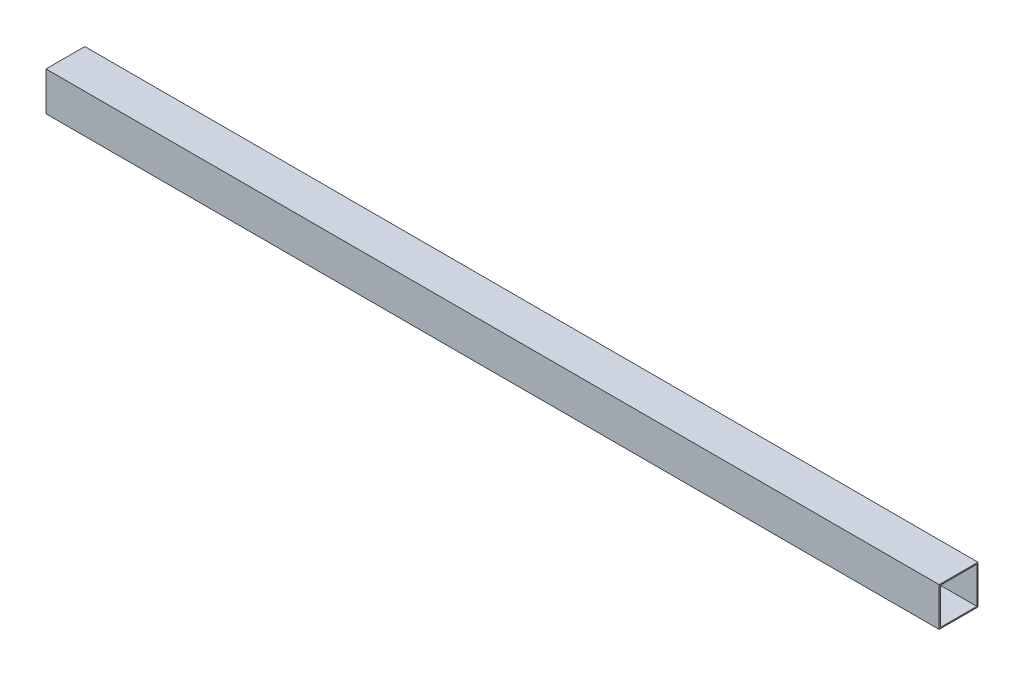
ISO-10303-21;
HEADER;
FILE_DESCRIPTION(('STEP AP214'),'2;1');
FILE_NAME('part.step','',(''),(''),'','','');
FILE_SCHEMA(('AUTOMOTIVE_DESIGN { 1 0 10303 214 1 1 1 1 }'));
ENDSEC;
DATA;
#1=APPLICATION_CONTEXT('core data for automotive mechanical design processes');
#2=APPLICATION_PROTOCOL_DEFINITION('international standard','automotive_design',2000,#1);
#3=PRODUCT_CONTEXT('',#1,'mechanical');
#4=PRODUCT('Part','Part','',(#3));
#5=PRODUCT_RELATED_PRODUCT_CATEGORY('part','',(#4));
#6=PRODUCT_DEFINITION_FORMATION('','',#4);
#7=PRODUCT_DEFINITION_CONTEXT('part definition',#1,'design');
#8=PRODUCT_DEFINITION('design','',#6,#7);
#9=PRODUCT_DEFINITION_SHAPE('','',#8);
#10=(LENGTH_UNIT() NAMED_UNIT(*) SI_UNIT(.MILLI.,.METRE.));
#11=(NAMED_UNIT(*) PLANE_ANGLE_UNIT() SI_UNIT($,.RADIAN.));
#12=(NAMED_UNIT(*) SI_UNIT($,.STERADIAN.) SOLID_ANGLE_UNIT());
#13=UNCERTAINTY_MEASURE_WITH_UNIT(LENGTH_MEASURE(1.E-05),#10,'distance_accuracy_value','');
#14=(GEOMETRIC_REPRESENTATION_CONTEXT(3) GLOBAL_UNCERTAINTY_ASSIGNED_CONTEXT((#13)) GLOBAL_UNIT_ASSIGNED_CONTEXT((#10,
#11,#12)) REPRESENTATION_CONTEXT('',''));
#15=CARTESIAN_POINT('',(0.,0.,0.));
#16=DIRECTION('',(0.,0.,1.));
#17=DIRECTION('',(1.,0.,0.));
#18=AXIS2_PLACEMENT_3D('',#15,#16,#17);
#19=CARTESIAN_POINT('',(584.2,0.,0.));
#20=DIRECTION('',(1.,0.,0.));
#21=DIRECTION('',(0.,0.,-1.));
#22=AXIS2_PLACEMENT_3D('',#19,#20,#21);
#23=PLANE('',#22);
#24=DIRECTION('',(0.,-1.,0.));
#25=VECTOR('',#24,1.);
#26=CARTESIAN_POINT('',(584.2,0.,0.));
#27=LINE('',#26,#25);
#28=CARTESIAN_POINT('',(584.2,25.4,0.));
#29=VERTEX_POINT('',#28);
#30=CARTESIAN_POINT('',(584.2,0.,0.));
#31=VERTEX_POINT('',#30);
#32=EDGE_CURVE('E158',#29,#31,#27,.T.);
#33=ORIENTED_EDGE('',*,*,#32,.T.);
#34=DIRECTION('',(0.,0.,-1.));
#35=VECTOR('',#34,1.);
#36=CARTESIAN_POINT('',(584.2,0.,0.));
#37=LINE('',#36,#35);
#38=CARTESIAN_POINT('',(584.2,0.,-25.4));
#39=VERTEX_POINT('',#38);
#40=EDGE_CURVE('E161',#31,#39,#37,.T.);
#41=ORIENTED_EDGE('',*,*,#40,.T.);
#42=DIRECTION('',(0.,1.,0.));
#43=VECTOR('',#42,1.);
#44=CARTESIAN_POINT('',(584.2,0.,-25.4));
#45=LINE('',#44,#43);
#46=CARTESIAN_POINT('',(584.2,25.4,-25.4));
#47=VERTEX_POINT('',#46);
#48=EDGE_CURVE('E164',#39,#47,#45,.T.);
#49=ORIENTED_EDGE('',*,*,#48,.T.);
#50=DIRECTION('',(0.,0.,1.));
#51=VECTOR('',#50,1.);
#52=CARTESIAN_POINT('',(584.2,25.4,0.));
#53=LINE('',#52,#51);
#54=EDGE_CURVE('E166',#47,#29,#53,.T.);
#55=ORIENTED_EDGE('',*,*,#54,.T.);
#56=EDGE_LOOP('',(#33,#41,#49,#55));
#57=FACE_BOUND('',#56,.T.);
#58=DIRECTION('',(0.,0.,-1.));
#59=VECTOR('',#58,1.);
#60=CARTESIAN_POINT('',(584.2,0.762,0.));
#61=LINE('',#60,#59);
#62=CARTESIAN_POINT('',(584.2,0.762,-0.762));
#63=VERTEX_POINT('',#62);
#64=CARTESIAN_POINT('',(584.2,0.762,-24.638));
#65=VERTEX_POINT('',#64);
#66=EDGE_CURVE('E130',#63,#65,#61,.T.);
#67=ORIENTED_EDGE('',*,*,#66,.F.);
#68=DIRECTION('',(0.,-1.,0.));
#69=VECTOR('',#68,1.);
#70=CARTESIAN_POINT('',(584.2,0.,-0.762));
#71=LINE('',#70,#69);
#72=CARTESIAN_POINT('',(584.2,24.638,-0.762));
#73=VERTEX_POINT('',#72);
#74=EDGE_CURVE('E122',#73,#63,#71,.T.);
#75=ORIENTED_EDGE('',*,*,#74,.F.);
#76=DIRECTION('',(0.,0.,1.));
#77=VECTOR('',#76,1.);
#78=CARTESIAN_POINT('',(584.2,24.638,0.));
#79=LINE('',#78,#77);
#80=CARTESIAN_POINT('',(584.2,24.638,-24.638));
#81=VERTEX_POINT('',#80);
#82=EDGE_CURVE('E144',#81,#73,#79,.T.);
#83=ORIENTED_EDGE('',*,*,#82,.F.);
#84=DIRECTION('',(0.,1.,0.));
#85=VECTOR('',#84,1.);
#86=CARTESIAN_POINT('',(584.2,0.,-24.638));
#87=LINE('',#86,#85);
#88=EDGE_CURVE('E142',#65,#81,#87,.T.);
#89=ORIENTED_EDGE('',*,*,#88,.F.);
#90=EDGE_LOOP('',(#67,#75,#83,#89));
#91=FACE_BOUND('',#90,.T.);
#92=ADVANCED_FACE('F57',(#57,#91),#23,.T.);
#93=CARTESIAN_POINT('',(0.,0.,0.));
#94=DIRECTION('',(1.,0.,0.));
#95=DIRECTION('',(0.,0.,-1.));
#96=AXIS2_PLACEMENT_3D('',#93,#94,#95);
#97=PLANE('',#96);
#98=DIRECTION('',(0.,-1.,0.));
#99=VECTOR('',#98,1.);
#100=CARTESIAN_POINT('',(0.,0.,0.));
#101=LINE('',#100,#99);
#102=CARTESIAN_POINT('',(0.,25.4,0.));
#103=VERTEX_POINT('',#102);
#104=CARTESIAN_POINT('',(0.,0.,0.));
#105=VERTEX_POINT('',#104);
#106=EDGE_CURVE('E138',#103,#105,#101,.T.);
#107=ORIENTED_EDGE('',*,*,#106,.F.);
#108=DIRECTION('',(0.,0.,1.));
#109=VECTOR('',#108,1.);
#110=CARTESIAN_POINT('',(0.,25.4,0.));
#111=LINE('',#110,#109);
#112=CARTESIAN_POINT('',(0.,25.4,-25.4));
#113=VERTEX_POINT('',#112);
#114=EDGE_CURVE('E162',#113,#103,#111,.T.);
#115=ORIENTED_EDGE('',*,*,#114,.F.);
#116=DIRECTION('',(0.,1.,0.));
#117=VECTOR('',#116,1.);
#118=CARTESIAN_POINT('',(0.,0.,-25.4));
#119=LINE('',#118,#117);
#120=CARTESIAN_POINT('',(0.,0.,-25.4));
#121=VERTEX_POINT('',#120);
#122=EDGE_CURVE('E173',#121,#113,#119,.T.);
#123=ORIENTED_EDGE('',*,*,#122,.F.);
#124=DIRECTION('',(0.,0.,-1.));
#125=VECTOR('',#124,1.);
#126=CARTESIAN_POINT('',(0.,0.,0.));
#127=LINE('',#126,#125);
#128=EDGE_CURVE('E171',#105,#121,#127,.T.);
#129=ORIENTED_EDGE('',*,*,#128,.F.);
#130=EDGE_LOOP('',(#107,#115,#123,#129));
#131=FACE_BOUND('',#130,.T.);
#132=DIRECTION('',(0.,-1.,0.));
#133=VECTOR('',#132,1.);
#134=CARTESIAN_POINT('',(0.,0.,-0.762));
#135=LINE('',#134,#133);
#136=CARTESIAN_POINT('',(0.,24.638,-0.762));
#137=VERTEX_POINT('',#136);
#138=CARTESIAN_POINT('',(0.,0.762,-0.762));
#139=VERTEX_POINT('',#138);
#140=EDGE_CURVE('E80',#137,#139,#135,.T.);
#141=ORIENTED_EDGE('',*,*,#140,.T.);
#142=DIRECTION('',(0.,0.,-1.));
#143=VECTOR('',#142,1.);
#144=CARTESIAN_POINT('',(0.,0.762,0.));
#145=LINE('',#144,#143);
#146=CARTESIAN_POINT('',(0.,0.762,-24.638));
#147=VERTEX_POINT('',#146);
#148=EDGE_CURVE('E137',#139,#147,#145,.T.);
#149=ORIENTED_EDGE('',*,*,#148,.T.);
#150=DIRECTION('',(0.,1.,0.));
#151=VECTOR('',#150,1.);
#152=CARTESIAN_POINT('',(0.,0.,-24.638));
#153=LINE('',#152,#151);
#154=CARTESIAN_POINT('',(0.,24.638,-24.638));
#155=VERTEX_POINT('',#154);
#156=EDGE_CURVE('E150',#147,#155,#153,.T.);
#157=ORIENTED_EDGE('',*,*,#156,.T.);
#158=DIRECTION('',(0.,0.,1.));
#159=VECTOR('',#158,1.);
#160=CARTESIAN_POINT('',(0.,24.638,0.));
#161=LINE('',#160,#159);
#162=EDGE_CURVE('E131',#155,#137,#161,.T.);
#163=ORIENTED_EDGE('',*,*,#162,.T.);
#164=EDGE_LOOP('',(#141,#149,#157,#163));
#165=FACE_BOUND('',#164,.T.);
#166=ADVANCED_FACE('F191',(#131,#165),#97,.F.);
#167=CARTESIAN_POINT('',(584.2,0.,0.));
#168=DIRECTION('',(0.,0.,-1.));
#169=DIRECTION('',(-1.,0.,0.));
#170=AXIS2_PLACEMENT_3D('',#167,#168,#169);
#171=PLANE('',#170);
#172=ORIENTED_EDGE('',*,*,#106,.T.);
#173=DIRECTION('',(-1.,0.,0.));
#174=VECTOR('',#173,1.);
#175=CARTESIAN_POINT('',(584.2,0.,0.));
#176=LINE('',#175,#174);
#177=EDGE_CURVE('E12',#31,#105,#176,.T.);
#178=ORIENTED_EDGE('',*,*,#177,.F.);
#179=ORIENTED_EDGE('',*,*,#32,.F.);
#180=DIRECTION('',(-1.,0.,0.));
#181=VECTOR('',#180,1.);
#182=CARTESIAN_POINT('',(584.2,25.4,0.));
#183=LINE('',#182,#181);
#184=EDGE_CURVE('E168',#29,#103,#183,.T.);
#185=ORIENTED_EDGE('',*,*,#184,.T.);
#186=EDGE_LOOP('',(#172,#178,#179,#185));
#187=FACE_BOUND('',#186,.T.);
#188=ADVANCED_FACE('F59',(#187),#171,.F.);
#189=CARTESIAN_POINT('',(584.2,0.,0.));
#190=DIRECTION('',(0.,1.,0.));
#191=DIRECTION('',(0.,0.,1.));
#192=AXIS2_PLACEMENT_3D('',#189,#190,#191);
#193=PLANE('',#192);
#194=ORIENTED_EDGE('',*,*,#128,.T.);
#195=DIRECTION('',(-1.,0.,0.));
#196=VECTOR('',#195,1.);
#197=CARTESIAN_POINT('',(584.2,0.,-25.4));
#198=LINE('',#197,#196);
#199=EDGE_CURVE('E65',#39,#121,#198,.T.);
#200=ORIENTED_EDGE('',*,*,#199,.F.);
#201=ORIENTED_EDGE('',*,*,#40,.F.);
#202=ORIENTED_EDGE('',*,*,#177,.T.);
#203=EDGE_LOOP('',(#194,#200,#201,#202));
#204=FACE_BOUND('',#203,.T.);
#205=ADVANCED_FACE('F201',(#204),#193,.F.);
#206=CARTESIAN_POINT('',(584.2,0.,-25.4));
#207=DIRECTION('',(0.,0.,1.));
#208=DIRECTION('',(1.,0.,0.));
#209=AXIS2_PLACEMENT_3D('',#206,#207,#208);
#210=PLANE('',#209);
#211=ORIENTED_EDGE('',*,*,#122,.T.);
#212=DIRECTION('',(-1.,0.,0.));
#213=VECTOR('',#212,1.);
#214=CARTESIAN_POINT('',(584.2,25.4,-25.4));
#215=LINE('',#214,#213);
#216=EDGE_CURVE('E178',#47,#113,#215,.T.);
#217=ORIENTED_EDGE('',*,*,#216,.F.);
#218=ORIENTED_EDGE('',*,*,#48,.F.);
#219=ORIENTED_EDGE('',*,*,#199,.T.);
#220=EDGE_LOOP('',(#211,#217,#218,#219));
#221=FACE_BOUND('',#220,.T.);
#222=ADVANCED_FACE('F185',(#221),#210,.F.);
#223=CARTESIAN_POINT('',(584.2,25.4,0.));
#224=DIRECTION('',(0.,-1.,0.));
#225=DIRECTION('',(0.,0.,-1.));
#226=AXIS2_PLACEMENT_3D('',#223,#224,#225);
#227=PLANE('',#226);
#228=ORIENTED_EDGE('',*,*,#114,.T.);
#229=ORIENTED_EDGE('',*,*,#184,.F.);
#230=ORIENTED_EDGE('',*,*,#54,.F.);
#231=ORIENTED_EDGE('',*,*,#216,.T.);
#232=EDGE_LOOP('',(#228,#229,#230,#231));
#233=FACE_BOUND('',#232,.T.);
#234=ADVANCED_FACE('F195',(#233),#227,.F.);
#235=CARTESIAN_POINT('',(584.2,0.,-0.762));
#236=DIRECTION('',(0.,0.,-1.));
#237=DIRECTION('',(-1.,0.,0.));
#238=AXIS2_PLACEMENT_3D('',#235,#236,#237);
#239=PLANE('',#238);
#240=ORIENTED_EDGE('',*,*,#140,.F.);
#241=DIRECTION('',(-1.,0.,0.));
#242=VECTOR('',#241,1.);
#243=CARTESIAN_POINT('',(584.2,24.638,-0.762));
#244=LINE('',#243,#242);
#245=EDGE_CURVE('E126',#73,#137,#244,.T.);
#246=ORIENTED_EDGE('',*,*,#245,.F.);
#247=ORIENTED_EDGE('',*,*,#74,.T.);
#248=DIRECTION('',(-1.,0.,0.));
#249=VECTOR('',#248,1.);
#250=CARTESIAN_POINT('',(584.2,0.762,-0.762));
#251=LINE('',#250,#249);
#252=EDGE_CURVE('E125',#63,#139,#251,.T.);
#253=ORIENTED_EDGE('',*,*,#252,.T.);
#254=EDGE_LOOP('',(#240,#246,#247,#253));
#255=FACE_BOUND('',#254,.T.);
#256=ADVANCED_FACE('F124',(#255),#239,.T.);
#257=CARTESIAN_POINT('',(584.2,0.762,0.));
#258=DIRECTION('',(0.,1.,0.));
#259=DIRECTION('',(0.,0.,1.));
#260=AXIS2_PLACEMENT_3D('',#257,#258,#259);
#261=PLANE('',#260);
#262=ORIENTED_EDGE('',*,*,#148,.F.);
#263=ORIENTED_EDGE('',*,*,#252,.F.);
#264=ORIENTED_EDGE('',*,*,#66,.T.);
#265=DIRECTION('',(-1.,0.,0.));
#266=VECTOR('',#265,1.);
#267=CARTESIAN_POINT('',(584.2,0.762,-24.638));
#268=LINE('',#267,#266);
#269=EDGE_CURVE('E139',#65,#147,#268,.T.);
#270=ORIENTED_EDGE('',*,*,#269,.T.);
#271=EDGE_LOOP('',(#262,#263,#264,#270));
#272=FACE_BOUND('',#271,.T.);
#273=ADVANCED_FACE('F134',(#272),#261,.T.);
#274=CARTESIAN_POINT('',(584.2,0.,-24.638));
#275=DIRECTION('',(0.,0.,1.));
#276=DIRECTION('',(1.,0.,0.));
#277=AXIS2_PLACEMENT_3D('',#274,#275,#276);
#278=PLANE('',#277);
#279=ORIENTED_EDGE('',*,*,#156,.F.);
#280=ORIENTED_EDGE('',*,*,#269,.F.);
#281=ORIENTED_EDGE('',*,*,#88,.T.);
#282=DIRECTION('',(-1.,0.,0.));
#283=VECTOR('',#282,1.);
#284=CARTESIAN_POINT('',(584.2,24.638,-24.638));
#285=LINE('',#284,#283);
#286=EDGE_CURVE('E72',#81,#155,#285,.T.);
#287=ORIENTED_EDGE('',*,*,#286,.T.);
#288=EDGE_LOOP('',(#279,#280,#281,#287));
#289=FACE_BOUND('',#288,.T.);
#290=ADVANCED_FACE('F224',(#289),#278,.T.);
#291=CARTESIAN_POINT('',(584.2,24.638,0.));
#292=DIRECTION('',(0.,-1.,0.));
#293=DIRECTION('',(0.,0.,-1.));
#294=AXIS2_PLACEMENT_3D('',#291,#292,#293);
#295=PLANE('',#294);
#296=ORIENTED_EDGE('',*,*,#162,.F.);
#297=ORIENTED_EDGE('',*,*,#286,.F.);
#298=ORIENTED_EDGE('',*,*,#82,.T.);
#299=ORIENTED_EDGE('',*,*,#245,.T.);
#300=EDGE_LOOP('',(#296,#297,#298,#299));
#301=FACE_BOUND('',#300,.T.);
#302=ADVANCED_FACE('F228',(#301),#295,.T.);
#303=CLOSED_SHELL('',(#92,#166,#188,#205,#222,#234,#256,#273,#290,#302));
#304=MANIFOLD_SOLID_BREP('B2',#303);
#305=ADVANCED_BREP_SHAPE_REPRESENTATION('',(#18,#304),#14);
#306=SHAPE_DEFINITION_REPRESENTATION(#9,#305);
ENDSEC;
END-ISO-10303-21;
